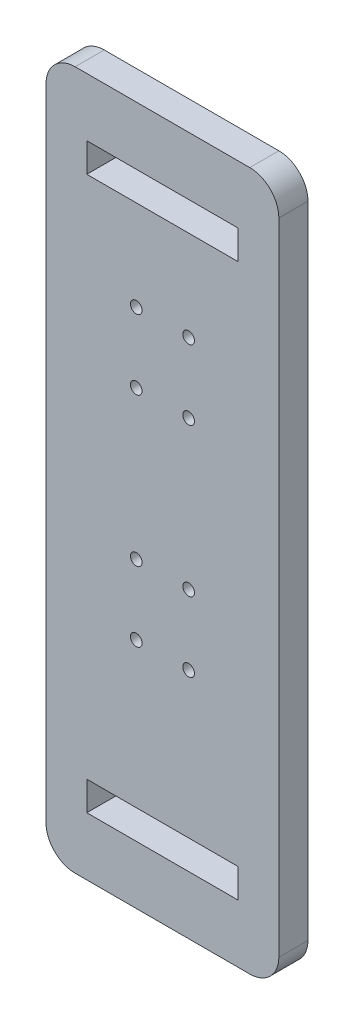
ISO-10303-21;
HEADER;
FILE_DESCRIPTION(('STEP AP214'),'2;1');
FILE_NAME('part.step','',(''),(''),'','','');
FILE_SCHEMA(('AUTOMOTIVE_DESIGN { 1 0 10303 214 1 1 1 1 }'));
ENDSEC;
DATA;
#1=APPLICATION_CONTEXT('core data for automotive mechanical design processes');
#2=APPLICATION_PROTOCOL_DEFINITION('international standard','automotive_design',2000,#1);
#3=PRODUCT_CONTEXT('',#1,'mechanical');
#4=PRODUCT('Part','Part','',(#3));
#5=PRODUCT_RELATED_PRODUCT_CATEGORY('part','',(#4));
#6=PRODUCT_DEFINITION_FORMATION('','',#4);
#7=PRODUCT_DEFINITION_CONTEXT('part definition',#1,'design');
#8=PRODUCT_DEFINITION('design','',#6,#7);
#9=PRODUCT_DEFINITION_SHAPE('','',#8);
#10=(LENGTH_UNIT() NAMED_UNIT(*) SI_UNIT(.MILLI.,.METRE.));
#11=(NAMED_UNIT(*) PLANE_ANGLE_UNIT() SI_UNIT($,.RADIAN.));
#12=(NAMED_UNIT(*) SI_UNIT($,.STERADIAN.) SOLID_ANGLE_UNIT());
#13=UNCERTAINTY_MEASURE_WITH_UNIT(LENGTH_MEASURE(1.E-05),#10,'distance_accuracy_value','');
#14=(GEOMETRIC_REPRESENTATION_CONTEXT(3) GLOBAL_UNCERTAINTY_ASSIGNED_CONTEXT((#13)) GLOBAL_UNIT_ASSIGNED_CONTEXT((#10,
#11,#12)) REPRESENTATION_CONTEXT('',''));
#15=CARTESIAN_POINT('',(0.,0.,0.));
#16=DIRECTION('',(0.,0.,1.));
#17=DIRECTION('',(1.,0.,0.));
#18=AXIS2_PLACEMENT_3D('',#15,#16,#17);
#19=CARTESIAN_POINT('',(0.,0.,10.));
#20=DIRECTION('',(-1.,0.,0.));
#21=DIRECTION('',(0.,0.,1.));
#22=AXIS2_PLACEMENT_3D('',#19,#20,#21);
#23=PLANE('',#22);
#24=DIRECTION('',(0.,1.,0.));
#25=VECTOR('',#24,1.);
#26=CARTESIAN_POINT('',(0.,0.,10.));
#27=LINE('',#26,#25);
#28=CARTESIAN_POINT('',(0.,10.,10.));
#29=VERTEX_POINT('',#28);
#30=CARTESIAN_POINT('',(0.,230.,10.));
#31=VERTEX_POINT('',#30);
#32=EDGE_CURVE('E264',#29,#31,#27,.T.);
#33=ORIENTED_EDGE('',*,*,#32,.F.);
#34=DIRECTION('',(0.,0.,-1.));
#35=VECTOR('',#34,1.);
#36=CARTESIAN_POINT('',(0.,10.,10.));
#37=LINE('',#36,#35);
#38=CARTESIAN_POINT('',(0.,10.,0.));
#39=VERTEX_POINT('',#38);
#40=EDGE_CURVE('E289',#29,#39,#37,.T.);
#41=ORIENTED_EDGE('',*,*,#40,.T.);
#42=DIRECTION('',(0.,1.,0.));
#43=VECTOR('',#42,1.);
#44=CARTESIAN_POINT('',(0.,0.,0.));
#45=LINE('',#44,#43);
#46=CARTESIAN_POINT('',(0.,230.,0.));
#47=VERTEX_POINT('',#46);
#48=EDGE_CURVE('E183',#39,#47,#45,.T.);
#49=ORIENTED_EDGE('',*,*,#48,.T.);
#50=DIRECTION('',(0.,0.,-1.));
#51=VECTOR('',#50,1.);
#52=CARTESIAN_POINT('',(0.,230.,10.));
#53=LINE('',#52,#51);
#54=EDGE_CURVE('E277',#47,#31,#53,.F.);
#55=ORIENTED_EDGE('',*,*,#54,.T.);
#56=EDGE_LOOP('',(#33,#41,#49,#55));
#57=FACE_BOUND('',#56,.T.);
#58=ADVANCED_FACE('F34',(#57),#23,.F.);
#59=CARTESIAN_POINT('',(0.,240.,10.));
#60=DIRECTION('',(0.,-1.,0.));
#61=DIRECTION('',(0.,0.,-1.));
#62=AXIS2_PLACEMENT_3D('',#59,#60,#61);
#63=PLANE('',#62);
#64=DIRECTION('',(-1.,0.,0.));
#65=VECTOR('',#64,1.);
#66=CARTESIAN_POINT('',(0.,240.,0.));
#67=LINE('',#66,#65);
#68=CARTESIAN_POINT('',(-10.,240.,0.));
#69=VERTEX_POINT('',#68);
#70=CARTESIAN_POINT('',(-70.,240.,0.));
#71=VERTEX_POINT('',#70);
#72=EDGE_CURVE('E280',#69,#71,#67,.T.);
#73=ORIENTED_EDGE('',*,*,#72,.T.);
#74=DIRECTION('',(0.,0.,-1.));
#75=VECTOR('',#74,1.);
#76=CARTESIAN_POINT('',(-70.,240.,10.));
#77=LINE('',#76,#75);
#78=CARTESIAN_POINT('',(-70.,240.,10.));
#79=VERTEX_POINT('',#78);
#80=EDGE_CURVE('E11',#71,#79,#77,.F.);
#81=ORIENTED_EDGE('',*,*,#80,.T.);
#82=DIRECTION('',(-1.,0.,0.));
#83=VECTOR('',#82,1.);
#84=CARTESIAN_POINT('',(0.,240.,10.));
#85=LINE('',#84,#83);
#86=CARTESIAN_POINT('',(-10.,240.,10.));
#87=VERTEX_POINT('',#86);
#88=EDGE_CURVE('E267',#87,#79,#85,.T.);
#89=ORIENTED_EDGE('',*,*,#88,.F.);
#90=DIRECTION('',(0.,0.,-1.));
#91=VECTOR('',#90,1.);
#92=CARTESIAN_POINT('',(-10.,240.,10.));
#93=LINE('',#92,#91);
#94=EDGE_CURVE('E42',#87,#69,#93,.T.);
#95=ORIENTED_EDGE('',*,*,#94,.T.);
#96=EDGE_LOOP('',(#73,#81,#89,#95));
#97=FACE_BOUND('',#96,.T.);
#98=ADVANCED_FACE('F322',(#97),#63,.F.);
#99=CARTESIAN_POINT('',(-80.,0.,10.));
#100=DIRECTION('',(1.,0.,0.));
#101=DIRECTION('',(0.,1.,0.));
#102=AXIS2_PLACEMENT_3D('',#99,#100,#101);
#103=PLANE('',#102);
#104=DIRECTION('',(0.,-1.,0.));
#105=VECTOR('',#104,1.);
#106=CARTESIAN_POINT('',(-80.,0.,0.));
#107=LINE('',#106,#105);
#108=CARTESIAN_POINT('',(-80.,230.,0.));
#109=VERTEX_POINT('',#108);
#110=CARTESIAN_POINT('',(-80.,9.99999999999999,0.));
#111=VERTEX_POINT('',#110);
#112=EDGE_CURVE('E283',#109,#111,#107,.T.);
#113=ORIENTED_EDGE('',*,*,#112,.T.);
#114=DIRECTION('',(0.,0.,-1.));
#115=VECTOR('',#114,1.);
#116=CARTESIAN_POINT('',(-80.,9.99999999999999,10.));
#117=LINE('',#116,#115);
#118=CARTESIAN_POINT('',(-80.,9.99999999999999,10.));
#119=VERTEX_POINT('',#118);
#120=EDGE_CURVE('E316',#111,#119,#117,.F.);
#121=ORIENTED_EDGE('',*,*,#120,.T.);
#122=DIRECTION('',(0.,-1.,0.));
#123=VECTOR('',#122,1.);
#124=CARTESIAN_POINT('',(-80.,0.,10.));
#125=LINE('',#124,#123);
#126=CARTESIAN_POINT('',(-80.,230.,10.));
#127=VERTEX_POINT('',#126);
#128=EDGE_CURVE('E271',#127,#119,#125,.T.);
#129=ORIENTED_EDGE('',*,*,#128,.F.);
#130=DIRECTION('',(0.,0.,-1.));
#131=VECTOR('',#130,1.);
#132=CARTESIAN_POINT('',(-80.,230.,10.));
#133=LINE('',#132,#131);
#134=EDGE_CURVE('E313',#127,#109,#133,.T.);
#135=ORIENTED_EDGE('',*,*,#134,.T.);
#136=EDGE_LOOP('',(#113,#121,#129,#135));
#137=FACE_BOUND('',#136,.T.);
#138=ADVANCED_FACE('F335',(#137),#103,.F.);
#139=CARTESIAN_POINT('',(0.,0.,10.));
#140=DIRECTION('',(0.,1.,0.));
#141=DIRECTION('',(-1.,0.,0.));
#142=AXIS2_PLACEMENT_3D('',#139,#140,#141);
#143=PLANE('',#142);
#144=DIRECTION('',(1.,0.,0.));
#145=VECTOR('',#144,1.);
#146=CARTESIAN_POINT('',(0.,0.,0.));
#147=LINE('',#146,#145);
#148=CARTESIAN_POINT('',(-70.,0.,0.));
#149=VERTEX_POINT('',#148);
#150=CARTESIAN_POINT('',(-10.,0.,0.));
#151=VERTEX_POINT('',#150);
#152=EDGE_CURVE('E268',#149,#151,#147,.T.);
#153=ORIENTED_EDGE('',*,*,#152,.T.);
#154=DIRECTION('',(0.,0.,-1.));
#155=VECTOR('',#154,1.);
#156=CARTESIAN_POINT('',(-10.,0.,10.));
#157=LINE('',#156,#155);
#158=CARTESIAN_POINT('',(-10.,0.,10.));
#159=VERTEX_POINT('',#158);
#160=EDGE_CURVE('E303',#151,#159,#157,.F.);
#161=ORIENTED_EDGE('',*,*,#160,.T.);
#162=DIRECTION('',(1.,0.,0.));
#163=VECTOR('',#162,1.);
#164=CARTESIAN_POINT('',(0.,0.,10.));
#165=LINE('',#164,#163);
#166=CARTESIAN_POINT('',(-70.,0.,10.));
#167=VERTEX_POINT('',#166);
#168=EDGE_CURVE('E274',#167,#159,#165,.T.);
#169=ORIENTED_EDGE('',*,*,#168,.F.);
#170=DIRECTION('',(0.,0.,-1.));
#171=VECTOR('',#170,1.);
#172=CARTESIAN_POINT('',(-70.,0.,10.));
#173=LINE('',#172,#171);
#174=EDGE_CURVE('E300',#167,#149,#173,.T.);
#175=ORIENTED_EDGE('',*,*,#174,.T.);
#176=EDGE_LOOP('',(#153,#161,#169,#175));
#177=FACE_BOUND('',#176,.T.);
#178=ADVANCED_FACE('F346',(#177),#143,.F.);
#179=CARTESIAN_POINT('',(0.,0.,10.));
#180=DIRECTION('',(0.,0.,1.));
#181=DIRECTION('',(1.,0.,0.));
#182=AXIS2_PLACEMENT_3D('',#179,#180,#181);
#183=PLANE('',#182);
#184=DIRECTION('',(0.,-1.,0.));
#185=VECTOR('',#184,1.);
#186=CARTESIAN_POINT('',(-66.,210.,10.));
#187=LINE('',#186,#185);
#188=CARTESIAN_POINT('',(-66.,220.,10.));
#189=VERTEX_POINT('',#188);
#190=CARTESIAN_POINT('',(-66.,210.,10.));
#191=VERTEX_POINT('',#190);
#192=EDGE_CURVE('E49',#189,#191,#187,.T.);
#193=ORIENTED_EDGE('',*,*,#192,.F.);
#194=DIRECTION('',(-1.,0.,0.));
#195=VECTOR('',#194,1.);
#196=CARTESIAN_POINT('',(-14.,220.,10.));
#197=LINE('',#196,#195);
#198=CARTESIAN_POINT('',(-14.,220.,10.));
#199=VERTEX_POINT('',#198);
#200=EDGE_CURVE('E167',#199,#189,#197,.T.);
#201=ORIENTED_EDGE('',*,*,#200,.F.);
#202=DIRECTION('',(0.,1.,0.));
#203=VECTOR('',#202,1.);
#204=CARTESIAN_POINT('',(-14.,210.,10.));
#205=LINE('',#204,#203);
#206=CARTESIAN_POINT('',(-14.,210.,10.));
#207=VERTEX_POINT('',#206);
#208=EDGE_CURVE('E170',#207,#199,#205,.T.);
#209=ORIENTED_EDGE('',*,*,#208,.F.);
#210=DIRECTION('',(1.,0.,0.));
#211=VECTOR('',#210,1.);
#212=CARTESIAN_POINT('',(-14.,210.,10.));
#213=LINE('',#212,#211);
#214=EDGE_CURVE('E176',#191,#207,#213,.T.);
#215=ORIENTED_EDGE('',*,*,#214,.F.);
#216=EDGE_LOOP('',(#193,#201,#209,#215));
#217=FACE_BOUND('',#216,.T.);
#218=CARTESIAN_POINT('',(-48.9999999999992,103.94,10.));
#219=DIRECTION('',(0.,0.,1.));
#220=DIRECTION('',(1.,0.,0.));
#221=AXIS2_PLACEMENT_3D('',#218,#219,#220);
#222=CIRCLE('',#221,2.);
#223=CARTESIAN_POINT('',(-46.9999999999992,103.94,10.));
#224=VERTEX_POINT('',#223);
#225=EDGE_CURVE('E191',#224,#224,#222,.T.);
#226=ORIENTED_EDGE('',*,*,#225,.F.);
#227=EDGE_LOOP('',(#226));
#228=FACE_BOUND('',#227,.T.);
#229=CARTESIAN_POINT('',(-31.,178.94,10.));
#230=DIRECTION('',(0.,0.,1.));
#231=DIRECTION('',(1.,0.,0.));
#232=AXIS2_PLACEMENT_3D('',#229,#230,#231);
#233=CIRCLE('',#232,2.);
#234=CARTESIAN_POINT('',(-29.,178.94,10.));
#235=VERTEX_POINT('',#234);
#236=EDGE_CURVE('E197',#235,#235,#233,.T.);
#237=ORIENTED_EDGE('',*,*,#236,.F.);
#238=EDGE_LOOP('',(#237));
#239=FACE_BOUND('',#238,.T.);
#240=CARTESIAN_POINT('',(-31.,154.94,10.));
#241=DIRECTION('',(0.,0.,1.));
#242=DIRECTION('',(1.,0.,0.));
#243=AXIS2_PLACEMENT_3D('',#240,#241,#242);
#244=CIRCLE('',#243,2.);
#245=CARTESIAN_POINT('',(-29.,154.94,10.));
#246=VERTEX_POINT('',#245);
#247=EDGE_CURVE('E222',#246,#246,#244,.T.);
#248=ORIENTED_EDGE('',*,*,#247,.F.);
#249=EDGE_LOOP('',(#248));
#250=FACE_BOUND('',#249,.T.);
#251=CARTESIAN_POINT('',(-49.,154.94,10.));
#252=DIRECTION('',(0.,0.,1.));
#253=DIRECTION('',(1.,0.,0.));
#254=AXIS2_PLACEMENT_3D('',#251,#252,#253);
#255=CIRCLE('',#254,2.);
#256=CARTESIAN_POINT('',(-47.,154.94,10.));
#257=VERTEX_POINT('',#256);
#258=EDGE_CURVE('E221',#257,#257,#255,.T.);
#259=ORIENTED_EDGE('',*,*,#258,.F.);
#260=EDGE_LOOP('',(#259));
#261=FACE_BOUND('',#260,.T.);
#262=DIRECTION('',(0.,-1.,0.));
#263=VECTOR('',#262,1.);
#264=CARTESIAN_POINT('',(-66.,20.,10.));
#265=LINE('',#264,#263);
#266=CARTESIAN_POINT('',(-66.,30.,10.));
#267=VERTEX_POINT('',#266);
#268=CARTESIAN_POINT('',(-66.,20.,10.));
#269=VERTEX_POINT('',#268);
#270=EDGE_CURVE('E57',#267,#269,#265,.T.);
#271=ORIENTED_EDGE('',*,*,#270,.F.);
#272=DIRECTION('',(-1.,0.,0.));
#273=VECTOR('',#272,1.);
#274=CARTESIAN_POINT('',(-14.,30.,10.));
#275=LINE('',#274,#273);
#276=CARTESIAN_POINT('',(-14.,30.,10.));
#277=VERTEX_POINT('',#276);
#278=EDGE_CURVE('E234',#277,#267,#275,.T.);
#279=ORIENTED_EDGE('',*,*,#278,.F.);
#280=DIRECTION('',(0.,1.,0.));
#281=VECTOR('',#280,1.);
#282=CARTESIAN_POINT('',(-14.,20.,10.));
#283=LINE('',#282,#281);
#284=CARTESIAN_POINT('',(-14.,20.,10.));
#285=VERTEX_POINT('',#284);
#286=EDGE_CURVE('E249',#285,#277,#283,.T.);
#287=ORIENTED_EDGE('',*,*,#286,.F.);
#288=DIRECTION('',(1.,0.,0.));
#289=VECTOR('',#288,1.);
#290=CARTESIAN_POINT('',(-14.,20.,10.));
#291=LINE('',#290,#289);
#292=EDGE_CURVE('E245',#269,#285,#291,.T.);
#293=ORIENTED_EDGE('',*,*,#292,.F.);
#294=EDGE_LOOP('',(#271,#279,#287,#293));
#295=FACE_BOUND('',#294,.T.);
#296=CARTESIAN_POINT('',(-49.,178.94,10.));
#297=DIRECTION('',(0.,0.,1.));
#298=DIRECTION('',(1.,0.,0.));
#299=AXIS2_PLACEMENT_3D('',#296,#297,#298);
#300=CIRCLE('',#299,2.);
#301=CARTESIAN_POINT('',(-47.,178.94,10.));
#302=VERTEX_POINT('',#301);
#303=EDGE_CURVE('E198',#302,#302,#300,.T.);
#304=ORIENTED_EDGE('',*,*,#303,.F.);
#305=EDGE_LOOP('',(#304));
#306=FACE_BOUND('',#305,.T.);
#307=CARTESIAN_POINT('',(-48.9999999999992,79.94,10.));
#308=DIRECTION('',(0.,0.,1.));
#309=DIRECTION('',(1.,0.,0.));
#310=AXIS2_PLACEMENT_3D('',#307,#308,#309);
#311=CIRCLE('',#310,2.);
#312=CARTESIAN_POINT('',(-46.9999999999992,79.94,10.));
#313=VERTEX_POINT('',#312);
#314=EDGE_CURVE('E204',#313,#313,#311,.T.);
#315=ORIENTED_EDGE('',*,*,#314,.F.);
#316=EDGE_LOOP('',(#315));
#317=FACE_BOUND('',#316,.T.);
#318=CARTESIAN_POINT('',(-30.9999999999992,79.94,10.));
#319=DIRECTION('',(0.,0.,1.));
#320=DIRECTION('',(1.,0.,0.));
#321=AXIS2_PLACEMENT_3D('',#318,#319,#320);
#322=CIRCLE('',#321,2.);
#323=CARTESIAN_POINT('',(-28.9999999999992,79.94,10.));
#324=VERTEX_POINT('',#323);
#325=EDGE_CURVE('E210',#324,#324,#322,.T.);
#326=ORIENTED_EDGE('',*,*,#325,.F.);
#327=EDGE_LOOP('',(#326));
#328=FACE_BOUND('',#327,.T.);
#329=CARTESIAN_POINT('',(-30.9999999999992,103.94,10.));
#330=DIRECTION('',(0.,0.,1.));
#331=DIRECTION('',(1.,0.,0.));
#332=AXIS2_PLACEMENT_3D('',#329,#330,#331);
#333=CIRCLE('',#332,2.);
#334=CARTESIAN_POINT('',(-28.9999999999992,103.94,10.));
#335=VERTEX_POINT('',#334);
#336=EDGE_CURVE('E190',#335,#335,#333,.T.);
#337=ORIENTED_EDGE('',*,*,#336,.F.);
#338=EDGE_LOOP('',(#337));
#339=FACE_BOUND('',#338,.T.);
#340=ORIENTED_EDGE('',*,*,#168,.T.);
#341=CARTESIAN_POINT('',(-10.,10.,10.));
#342=DIRECTION('',(0.,0.,1.));
#343=DIRECTION('',(1.,0.,0.));
#344=AXIS2_PLACEMENT_3D('',#341,#342,#343);
#345=CIRCLE('',#344,10.);
#346=EDGE_CURVE('E311',#159,#29,#345,.T.);
#347=ORIENTED_EDGE('',*,*,#346,.T.);
#348=ORIENTED_EDGE('',*,*,#32,.T.);
#349=CARTESIAN_POINT('',(-10.,230.,10.));
#350=DIRECTION('',(0.,0.,1.));
#351=DIRECTION('',(1.,0.,0.));
#352=AXIS2_PLACEMENT_3D('',#349,#350,#351);
#353=CIRCLE('',#352,10.);
#354=EDGE_CURVE('E305',#31,#87,#353,.T.);
#355=ORIENTED_EDGE('',*,*,#354,.T.);
#356=ORIENTED_EDGE('',*,*,#88,.T.);
#357=CARTESIAN_POINT('',(-70.,230.,10.));
#358=DIRECTION('',(0.,0.,1.));
#359=DIRECTION('',(1.,0.,0.));
#360=AXIS2_PLACEMENT_3D('',#357,#358,#359);
#361=CIRCLE('',#360,10.);
#362=EDGE_CURVE('E307',#79,#127,#361,.T.);
#363=ORIENTED_EDGE('',*,*,#362,.T.);
#364=ORIENTED_EDGE('',*,*,#128,.T.);
#365=CARTESIAN_POINT('',(-70.,9.99999999999999,10.));
#366=DIRECTION('',(0.,0.,1.));
#367=DIRECTION('',(1.,0.,0.));
#368=AXIS2_PLACEMENT_3D('',#365,#366,#367);
#369=CIRCLE('',#368,10.);
#370=EDGE_CURVE('E309',#119,#167,#369,.T.);
#371=ORIENTED_EDGE('',*,*,#370,.T.);
#372=EDGE_LOOP('',(#340,#347,#348,#355,#356,#363,#364,#371));
#373=FACE_BOUND('',#372,.T.);
#374=ADVANCED_FACE('F339',(#217,#228,#239,#250,#261,#295,#306,#317,#328,#339,#373),#183,.T.);
#375=CARTESIAN_POINT('',(0.,0.,0.));
#376=DIRECTION('',(0.,0.,1.));
#377=DIRECTION('',(1.,0.,0.));
#378=AXIS2_PLACEMENT_3D('',#375,#376,#377);
#379=PLANE('',#378);
#380=DIRECTION('',(-1.,0.,0.));
#381=VECTOR('',#380,1.);
#382=CARTESIAN_POINT('',(-14.,220.,0.));
#383=LINE('',#382,#381);
#384=CARTESIAN_POINT('',(-14.,220.,0.));
#385=VERTEX_POINT('',#384);
#386=CARTESIAN_POINT('',(-66.,220.,0.));
#387=VERTEX_POINT('',#386);
#388=EDGE_CURVE('E154',#385,#387,#383,.T.);
#389=ORIENTED_EDGE('',*,*,#388,.T.);
#390=DIRECTION('',(0.,-1.,0.));
#391=VECTOR('',#390,1.);
#392=CARTESIAN_POINT('',(-66.,210.,0.));
#393=LINE('',#392,#391);
#394=CARTESIAN_POINT('',(-66.,210.,0.));
#395=VERTEX_POINT('',#394);
#396=EDGE_CURVE('E148',#387,#395,#393,.T.);
#397=ORIENTED_EDGE('',*,*,#396,.T.);
#398=DIRECTION('',(1.,0.,0.));
#399=VECTOR('',#398,1.);
#400=CARTESIAN_POINT('',(-14.,210.,0.));
#401=LINE('',#400,#399);
#402=CARTESIAN_POINT('',(-14.,210.,0.));
#403=VERTEX_POINT('',#402);
#404=EDGE_CURVE('E158',#395,#403,#401,.T.);
#405=ORIENTED_EDGE('',*,*,#404,.T.);
#406=DIRECTION('',(0.,1.,0.));
#407=VECTOR('',#406,1.);
#408=CARTESIAN_POINT('',(-14.,210.,0.));
#409=LINE('',#408,#407);
#410=EDGE_CURVE('E162',#403,#385,#409,.T.);
#411=ORIENTED_EDGE('',*,*,#410,.T.);
#412=EDGE_LOOP('',(#389,#397,#405,#411));
#413=FACE_BOUND('',#412,.T.);
#414=CARTESIAN_POINT('',(-48.9999999999992,103.94,0.));
#415=DIRECTION('',(0.,0.,1.));
#416=DIRECTION('',(1.,0.,0.));
#417=AXIS2_PLACEMENT_3D('',#414,#415,#416);
#418=CIRCLE('',#417,2.);
#419=CARTESIAN_POINT('',(-46.9999999999992,103.94,0.));
#420=VERTEX_POINT('',#419);
#421=EDGE_CURVE('E187',#420,#420,#418,.T.);
#422=ORIENTED_EDGE('',*,*,#421,.T.);
#423=EDGE_LOOP('',(#422));
#424=FACE_BOUND('',#423,.T.);
#425=CARTESIAN_POINT('',(-31.,178.94,0.));
#426=DIRECTION('',(0.,0.,1.));
#427=DIRECTION('',(1.,0.,0.));
#428=AXIS2_PLACEMENT_3D('',#425,#426,#427);
#429=CIRCLE('',#428,2.);
#430=CARTESIAN_POINT('',(-29.,178.94,0.));
#431=VERTEX_POINT('',#430);
#432=EDGE_CURVE('E225',#431,#431,#429,.T.);
#433=ORIENTED_EDGE('',*,*,#432,.T.);
#434=EDGE_LOOP('',(#433));
#435=FACE_BOUND('',#434,.T.);
#436=CARTESIAN_POINT('',(-31.,154.94,0.));
#437=DIRECTION('',(0.,0.,1.));
#438=DIRECTION('',(1.,0.,0.));
#439=AXIS2_PLACEMENT_3D('',#436,#437,#438);
#440=CIRCLE('',#439,2.);
#441=CARTESIAN_POINT('',(-29.,154.94,0.));
#442=VERTEX_POINT('',#441);
#443=EDGE_CURVE('E218',#442,#442,#440,.T.);
#444=ORIENTED_EDGE('',*,*,#443,.T.);
#445=EDGE_LOOP('',(#444));
#446=FACE_BOUND('',#445,.T.);
#447=CARTESIAN_POINT('',(-49.,154.94,0.));
#448=DIRECTION('',(0.,0.,1.));
#449=DIRECTION('',(1.,0.,0.));
#450=AXIS2_PLACEMENT_3D('',#447,#448,#449);
#451=CIRCLE('',#450,2.);
#452=CARTESIAN_POINT('',(-47.,154.94,0.));
#453=VERTEX_POINT('',#452);
#454=EDGE_CURVE('E246',#453,#453,#451,.T.);
#455=ORIENTED_EDGE('',*,*,#454,.T.);
#456=EDGE_LOOP('',(#455));
#457=FACE_BOUND('',#456,.T.);
#458=DIRECTION('',(-1.,0.,0.));
#459=VECTOR('',#458,1.);
#460=CARTESIAN_POINT('',(-14.,30.,0.));
#461=LINE('',#460,#459);
#462=CARTESIAN_POINT('',(-14.,30.,0.));
#463=VERTEX_POINT('',#462);
#464=CARTESIAN_POINT('',(-66.,30.,0.));
#465=VERTEX_POINT('',#464);
#466=EDGE_CURVE('E240',#463,#465,#461,.T.);
#467=ORIENTED_EDGE('',*,*,#466,.T.);
#468=DIRECTION('',(0.,-1.,0.));
#469=VECTOR('',#468,1.);
#470=CARTESIAN_POINT('',(-66.,20.,0.));
#471=LINE('',#470,#469);
#472=CARTESIAN_POINT('',(-66.,20.,0.));
#473=VERTEX_POINT('',#472);
#474=EDGE_CURVE('E230',#465,#473,#471,.T.);
#475=ORIENTED_EDGE('',*,*,#474,.T.);
#476=DIRECTION('',(1.,0.,0.));
#477=VECTOR('',#476,1.);
#478=CARTESIAN_POINT('',(-14.,20.,0.));
#479=LINE('',#478,#477);
#480=CARTESIAN_POINT('',(-14.,20.,0.));
#481=VERTEX_POINT('',#480);
#482=EDGE_CURVE('E233',#473,#481,#479,.T.);
#483=ORIENTED_EDGE('',*,*,#482,.T.);
#484=DIRECTION('',(0.,1.,0.));
#485=VECTOR('',#484,1.);
#486=CARTESIAN_POINT('',(-14.,20.,0.));
#487=LINE('',#486,#485);
#488=EDGE_CURVE('E237',#481,#463,#487,.T.);
#489=ORIENTED_EDGE('',*,*,#488,.T.);
#490=EDGE_LOOP('',(#467,#475,#483,#489));
#491=FACE_BOUND('',#490,.T.);
#492=CARTESIAN_POINT('',(-49.,178.94,0.));
#493=DIRECTION('',(0.,0.,1.));
#494=DIRECTION('',(1.,0.,0.));
#495=AXIS2_PLACEMENT_3D('',#492,#493,#494);
#496=CIRCLE('',#495,2.);
#497=CARTESIAN_POINT('',(-47.,178.94,0.));
#498=VERTEX_POINT('',#497);
#499=EDGE_CURVE('E194',#498,#498,#496,.T.);
#500=ORIENTED_EDGE('',*,*,#499,.T.);
#501=EDGE_LOOP('',(#500));
#502=FACE_BOUND('',#501,.T.);
#503=CARTESIAN_POINT('',(-48.9999999999992,79.94,0.));
#504=DIRECTION('',(0.,0.,1.));
#505=DIRECTION('',(1.,0.,0.));
#506=AXIS2_PLACEMENT_3D('',#503,#504,#505);
#507=CIRCLE('',#506,2.);
#508=CARTESIAN_POINT('',(-46.9999999999992,79.94,0.));
#509=VERTEX_POINT('',#508);
#510=EDGE_CURVE('E201',#509,#509,#507,.T.);
#511=ORIENTED_EDGE('',*,*,#510,.T.);
#512=EDGE_LOOP('',(#511));
#513=FACE_BOUND('',#512,.T.);
#514=CARTESIAN_POINT('',(-30.9999999999992,79.94,0.));
#515=DIRECTION('',(0.,0.,1.));
#516=DIRECTION('',(1.,0.,0.));
#517=AXIS2_PLACEMENT_3D('',#514,#515,#516);
#518=CIRCLE('',#517,2.);
#519=CARTESIAN_POINT('',(-28.9999999999992,79.94,0.));
#520=VERTEX_POINT('',#519);
#521=EDGE_CURVE('E207',#520,#520,#518,.T.);
#522=ORIENTED_EDGE('',*,*,#521,.T.);
#523=EDGE_LOOP('',(#522));
#524=FACE_BOUND('',#523,.T.);
#525=CARTESIAN_POINT('',(-30.9999999999992,103.94,0.));
#526=DIRECTION('',(0.,0.,1.));
#527=DIRECTION('',(1.,0.,0.));
#528=AXIS2_PLACEMENT_3D('',#525,#526,#527);
#529=CIRCLE('',#528,2.);
#530=CARTESIAN_POINT('',(-28.9999999999992,103.94,0.));
#531=VERTEX_POINT('',#530);
#532=EDGE_CURVE('E213',#531,#531,#529,.T.);
#533=ORIENTED_EDGE('',*,*,#532,.T.);
#534=EDGE_LOOP('',(#533));
#535=FACE_BOUND('',#534,.T.);
#536=ORIENTED_EDGE('',*,*,#48,.F.);
#537=CARTESIAN_POINT('',(-10.,10.,0.));
#538=DIRECTION('',(0.,0.,1.));
#539=DIRECTION('',(1.,0.,0.));
#540=AXIS2_PLACEMENT_3D('',#537,#538,#539);
#541=CIRCLE('',#540,10.);
#542=EDGE_CURVE('E298',#39,#151,#541,.F.);
#543=ORIENTED_EDGE('',*,*,#542,.T.);
#544=ORIENTED_EDGE('',*,*,#152,.F.);
#545=CARTESIAN_POINT('',(-70.,9.99999999999999,0.));
#546=DIRECTION('',(0.,0.,1.));
#547=DIRECTION('',(1.,0.,0.));
#548=AXIS2_PLACEMENT_3D('',#545,#546,#547);
#549=CIRCLE('',#548,10.);
#550=EDGE_CURVE('E296',#149,#111,#549,.F.);
#551=ORIENTED_EDGE('',*,*,#550,.T.);
#552=ORIENTED_EDGE('',*,*,#112,.F.);
#553=CARTESIAN_POINT('',(-70.,230.,0.));
#554=DIRECTION('',(0.,0.,1.));
#555=DIRECTION('',(1.,0.,0.));
#556=AXIS2_PLACEMENT_3D('',#553,#554,#555);
#557=CIRCLE('',#556,10.);
#558=EDGE_CURVE('E294',#109,#71,#557,.F.);
#559=ORIENTED_EDGE('',*,*,#558,.T.);
#560=ORIENTED_EDGE('',*,*,#72,.F.);
#561=CARTESIAN_POINT('',(-10.,230.,0.));
#562=DIRECTION('',(0.,0.,1.));
#563=DIRECTION('',(1.,0.,0.));
#564=AXIS2_PLACEMENT_3D('',#561,#562,#563);
#565=CIRCLE('',#564,10.);
#566=EDGE_CURVE('E292',#69,#47,#565,.F.);
#567=ORIENTED_EDGE('',*,*,#566,.T.);
#568=EDGE_LOOP('',(#536,#543,#544,#551,#552,#559,#560,#567));
#569=FACE_BOUND('',#568,.T.);
#570=ADVANCED_FACE('F164',(#413,#424,#435,#446,#457,#491,#502,#513,#524,#535,#569),#379,.F.);
#571=CARTESIAN_POINT('',(-10.,10.,10.));
#572=DIRECTION('',(0.,0.,-1.));
#573=DIRECTION('',(-1.,0.,0.));
#574=AXIS2_PLACEMENT_3D('',#571,#572,#573);
#575=CYLINDRICAL_SURFACE('',#574,10.);
#576=ORIENTED_EDGE('',*,*,#346,.F.);
#577=ORIENTED_EDGE('',*,*,#160,.F.);
#578=ORIENTED_EDGE('',*,*,#542,.F.);
#579=ORIENTED_EDGE('',*,*,#40,.F.);
#580=EDGE_LOOP('',(#576,#577,#578,#579));
#581=FACE_BOUND('',#580,.T.);
#582=ADVANCED_FACE('F351',(#581),#575,.T.);
#583=CARTESIAN_POINT('',(-70.,9.99999999999999,10.));
#584=DIRECTION('',(0.,0.,-1.));
#585=DIRECTION('',(-1.,0.,0.));
#586=AXIS2_PLACEMENT_3D('',#583,#584,#585);
#587=CYLINDRICAL_SURFACE('',#586,10.);
#588=ORIENTED_EDGE('',*,*,#370,.F.);
#589=ORIENTED_EDGE('',*,*,#120,.F.);
#590=ORIENTED_EDGE('',*,*,#550,.F.);
#591=ORIENTED_EDGE('',*,*,#174,.F.);
#592=EDGE_LOOP('',(#588,#589,#590,#591));
#593=FACE_BOUND('',#592,.T.);
#594=ADVANCED_FACE('F343',(#593),#587,.T.);
#595=CARTESIAN_POINT('',(-70.,230.,10.));
#596=DIRECTION('',(0.,0.,-1.));
#597=DIRECTION('',(-1.,0.,0.));
#598=AXIS2_PLACEMENT_3D('',#595,#596,#597);
#599=CYLINDRICAL_SURFACE('',#598,10.);
#600=ORIENTED_EDGE('',*,*,#362,.F.);
#601=ORIENTED_EDGE('',*,*,#80,.F.);
#602=ORIENTED_EDGE('',*,*,#558,.F.);
#603=ORIENTED_EDGE('',*,*,#134,.F.);
#604=EDGE_LOOP('',(#600,#601,#602,#603));
#605=FACE_BOUND('',#604,.T.);
#606=ADVANCED_FACE('F332',(#605),#599,.T.);
#607=CARTESIAN_POINT('',(-10.,230.,10.));
#608=DIRECTION('',(0.,0.,-1.));
#609=DIRECTION('',(-1.,0.,0.));
#610=AXIS2_PLACEMENT_3D('',#607,#608,#609);
#611=CYLINDRICAL_SURFACE('',#610,10.);
#612=ORIENTED_EDGE('',*,*,#354,.F.);
#613=ORIENTED_EDGE('',*,*,#54,.F.);
#614=ORIENTED_EDGE('',*,*,#566,.F.);
#615=ORIENTED_EDGE('',*,*,#94,.F.);
#616=EDGE_LOOP('',(#612,#613,#614,#615));
#617=FACE_BOUND('',#616,.T.);
#618=ADVANCED_FACE('F36',(#617),#611,.T.);
#619=CARTESIAN_POINT('',(-30.9999999999992,103.94,0.));
#620=DIRECTION('',(0.,0.,1.));
#621=DIRECTION('',(1.,0.,0.));
#622=AXIS2_PLACEMENT_3D('',#619,#620,#621);
#623=CYLINDRICAL_SURFACE('',#622,2.);
#624=ORIENTED_EDGE('',*,*,#532,.F.);
#625=EDGE_LOOP('',(#624));
#626=FACE_BOUND('',#625,.T.);
#627=ORIENTED_EDGE('',*,*,#336,.T.);
#628=EDGE_LOOP('',(#627));
#629=FACE_BOUND('',#628,.T.);
#630=ADVANCED_FACE('F356',(#626,#629),#623,.F.);
#631=CARTESIAN_POINT('',(-30.9999999999992,79.94,0.));
#632=DIRECTION('',(0.,0.,1.));
#633=DIRECTION('',(1.,0.,0.));
#634=AXIS2_PLACEMENT_3D('',#631,#632,#633);
#635=CYLINDRICAL_SURFACE('',#634,2.);
#636=ORIENTED_EDGE('',*,*,#521,.F.);
#637=EDGE_LOOP('',(#636));
#638=FACE_BOUND('',#637,.T.);
#639=ORIENTED_EDGE('',*,*,#325,.T.);
#640=EDGE_LOOP('',(#639));
#641=FACE_BOUND('',#640,.T.);
#642=ADVANCED_FACE('F361',(#638,#641),#635,.F.);
#643=CARTESIAN_POINT('',(-48.9999999999992,79.94,0.));
#644=DIRECTION('',(0.,0.,1.));
#645=DIRECTION('',(1.,0.,0.));
#646=AXIS2_PLACEMENT_3D('',#643,#644,#645);
#647=CYLINDRICAL_SURFACE('',#646,2.);
#648=ORIENTED_EDGE('',*,*,#510,.F.);
#649=EDGE_LOOP('',(#648));
#650=FACE_BOUND('',#649,.T.);
#651=ORIENTED_EDGE('',*,*,#314,.T.);
#652=EDGE_LOOP('',(#651));
#653=FACE_BOUND('',#652,.T.);
#654=ADVANCED_FACE('F422',(#650,#653),#647,.F.);
#655=CARTESIAN_POINT('',(-49.,178.94,0.));
#656=DIRECTION('',(0.,0.,1.));
#657=DIRECTION('',(1.,0.,0.));
#658=AXIS2_PLACEMENT_3D('',#655,#656,#657);
#659=CYLINDRICAL_SURFACE('',#658,2.);
#660=ORIENTED_EDGE('',*,*,#499,.F.);
#661=EDGE_LOOP('',(#660));
#662=FACE_BOUND('',#661,.T.);
#663=ORIENTED_EDGE('',*,*,#303,.T.);
#664=EDGE_LOOP('',(#663));
#665=FACE_BOUND('',#664,.T.);
#666=ADVANCED_FACE('F432',(#662,#665),#659,.F.);
#667=CARTESIAN_POINT('',(-66.,20.,0.));
#668=DIRECTION('',(-1.,0.,0.));
#669=DIRECTION('',(0.,0.,1.));
#670=AXIS2_PLACEMENT_3D('',#667,#668,#669);
#671=PLANE('',#670);
#672=ORIENTED_EDGE('',*,*,#270,.T.);
#673=DIRECTION('',(0.,0.,1.));
#674=VECTOR('',#673,1.);
#675=CARTESIAN_POINT('',(-66.,20.,0.));
#676=LINE('',#675,#674);
#677=EDGE_CURVE('E243',#473,#269,#676,.T.);
#678=ORIENTED_EDGE('',*,*,#677,.F.);
#679=ORIENTED_EDGE('',*,*,#474,.F.);
#680=DIRECTION('',(0.,0.,1.));
#681=VECTOR('',#680,1.);
#682=CARTESIAN_POINT('',(-66.,30.,0.));
#683=LINE('',#682,#681);
#684=EDGE_CURVE('E177',#465,#267,#683,.T.);
#685=ORIENTED_EDGE('',*,*,#684,.T.);
#686=EDGE_LOOP('',(#672,#678,#679,#685));
#687=FACE_BOUND('',#686,.T.);
#688=ADVANCED_FACE('F442',(#687),#671,.F.);
#689=CARTESIAN_POINT('',(-14.,30.,0.));
#690=DIRECTION('',(0.,1.,0.));
#691=DIRECTION('',(-1.,0.,0.));
#692=AXIS2_PLACEMENT_3D('',#689,#690,#691);
#693=PLANE('',#692);
#694=ORIENTED_EDGE('',*,*,#278,.T.);
#695=ORIENTED_EDGE('',*,*,#684,.F.);
#696=ORIENTED_EDGE('',*,*,#466,.F.);
#697=DIRECTION('',(0.,0.,1.));
#698=VECTOR('',#697,1.);
#699=CARTESIAN_POINT('',(-14.,30.,0.));
#700=LINE('',#699,#698);
#701=EDGE_CURVE('E255',#463,#277,#700,.T.);
#702=ORIENTED_EDGE('',*,*,#701,.T.);
#703=EDGE_LOOP('',(#694,#695,#696,#702));
#704=FACE_BOUND('',#703,.T.);
#705=ADVANCED_FACE('F452',(#704),#693,.F.);
#706=CARTESIAN_POINT('',(-14.,20.,0.));
#707=DIRECTION('',(1.,0.,0.));
#708=DIRECTION('',(0.,0.,-1.));
#709=AXIS2_PLACEMENT_3D('',#706,#707,#708);
#710=PLANE('',#709);
#711=ORIENTED_EDGE('',*,*,#286,.T.);
#712=ORIENTED_EDGE('',*,*,#701,.F.);
#713=ORIENTED_EDGE('',*,*,#488,.F.);
#714=DIRECTION('',(0.,0.,1.));
#715=VECTOR('',#714,1.);
#716=CARTESIAN_POINT('',(-14.,20.,0.));
#717=LINE('',#716,#715);
#718=EDGE_CURVE('E257',#481,#285,#717,.T.);
#719=ORIENTED_EDGE('',*,*,#718,.T.);
#720=EDGE_LOOP('',(#711,#712,#713,#719));
#721=FACE_BOUND('',#720,.T.);
#722=ADVANCED_FACE('F461',(#721),#710,.F.);
#723=CARTESIAN_POINT('',(-14.,20.,0.));
#724=DIRECTION('',(0.,-1.,0.));
#725=DIRECTION('',(1.,0.,0.));
#726=AXIS2_PLACEMENT_3D('',#723,#724,#725);
#727=PLANE('',#726);
#728=ORIENTED_EDGE('',*,*,#292,.T.);
#729=ORIENTED_EDGE('',*,*,#718,.F.);
#730=ORIENTED_EDGE('',*,*,#482,.F.);
#731=ORIENTED_EDGE('',*,*,#677,.T.);
#732=EDGE_LOOP('',(#728,#729,#730,#731));
#733=FACE_BOUND('',#732,.T.);
#734=ADVANCED_FACE('F471',(#733),#727,.F.);
#735=CARTESIAN_POINT('',(-49.,154.94,0.));
#736=DIRECTION('',(0.,0.,1.));
#737=DIRECTION('',(1.,0.,0.));
#738=AXIS2_PLACEMENT_3D('',#735,#736,#737);
#739=CYLINDRICAL_SURFACE('',#738,2.);
#740=ORIENTED_EDGE('',*,*,#454,.F.);
#741=EDGE_LOOP('',(#740));
#742=FACE_BOUND('',#741,.T.);
#743=ORIENTED_EDGE('',*,*,#258,.T.);
#744=EDGE_LOOP('',(#743));
#745=FACE_BOUND('',#744,.T.);
#746=ADVANCED_FACE('F481',(#742,#745),#739,.F.);
#747=CARTESIAN_POINT('',(-31.,154.94,0.));
#748=DIRECTION('',(0.,0.,1.));
#749=DIRECTION('',(1.,0.,0.));
#750=AXIS2_PLACEMENT_3D('',#747,#748,#749);
#751=CYLINDRICAL_SURFACE('',#750,2.);
#752=ORIENTED_EDGE('',*,*,#443,.F.);
#753=EDGE_LOOP('',(#752));
#754=FACE_BOUND('',#753,.T.);
#755=ORIENTED_EDGE('',*,*,#247,.T.);
#756=EDGE_LOOP('',(#755));
#757=FACE_BOUND('',#756,.T.);
#758=ADVANCED_FACE('F491',(#754,#757),#751,.F.);
#759=CARTESIAN_POINT('',(-31.,178.94,0.));
#760=DIRECTION('',(0.,0.,1.));
#761=DIRECTION('',(1.,0.,0.));
#762=AXIS2_PLACEMENT_3D('',#759,#760,#761);
#763=CYLINDRICAL_SURFACE('',#762,2.);
#764=ORIENTED_EDGE('',*,*,#432,.F.);
#765=EDGE_LOOP('',(#764));
#766=FACE_BOUND('',#765,.T.);
#767=ORIENTED_EDGE('',*,*,#236,.T.);
#768=EDGE_LOOP('',(#767));
#769=FACE_BOUND('',#768,.T.);
#770=ADVANCED_FACE('F501',(#766,#769),#763,.F.);
#771=CARTESIAN_POINT('',(-48.9999999999992,103.94,0.));
#772=DIRECTION('',(0.,0.,1.));
#773=DIRECTION('',(1.,0.,0.));
#774=AXIS2_PLACEMENT_3D('',#771,#772,#773);
#775=CYLINDRICAL_SURFACE('',#774,2.);
#776=ORIENTED_EDGE('',*,*,#421,.F.);
#777=EDGE_LOOP('',(#776));
#778=FACE_BOUND('',#777,.T.);
#779=ORIENTED_EDGE('',*,*,#225,.T.);
#780=EDGE_LOOP('',(#779));
#781=FACE_BOUND('',#780,.T.);
#782=ADVANCED_FACE('F511',(#778,#781),#775,.F.);
#783=CARTESIAN_POINT('',(-66.,210.,0.));
#784=DIRECTION('',(-1.,0.,0.));
#785=DIRECTION('',(0.,0.,1.));
#786=AXIS2_PLACEMENT_3D('',#783,#784,#785);
#787=PLANE('',#786);
#788=ORIENTED_EDGE('',*,*,#192,.T.);
#789=DIRECTION('',(0.,0.,1.));
#790=VECTOR('',#789,1.);
#791=CARTESIAN_POINT('',(-66.,210.,0.));
#792=LINE('',#791,#790);
#793=EDGE_CURVE('E144',#395,#191,#792,.T.);
#794=ORIENTED_EDGE('',*,*,#793,.F.);
#795=ORIENTED_EDGE('',*,*,#396,.F.);
#796=DIRECTION('',(0.,0.,1.));
#797=VECTOR('',#796,1.);
#798=CARTESIAN_POINT('',(-66.,220.,0.));
#799=LINE('',#798,#797);
#800=EDGE_CURVE('E181',#387,#189,#799,.T.);
#801=ORIENTED_EDGE('',*,*,#800,.T.);
#802=EDGE_LOOP('',(#788,#794,#795,#801));
#803=FACE_BOUND('',#802,.T.);
#804=ADVANCED_FACE('F146',(#803),#787,.F.);
#805=CARTESIAN_POINT('',(-14.,220.,0.));
#806=DIRECTION('',(0.,1.,0.));
#807=DIRECTION('',(0.,0.,1.));
#808=AXIS2_PLACEMENT_3D('',#805,#806,#807);
#809=PLANE('',#808);
#810=ORIENTED_EDGE('',*,*,#200,.T.);
#811=ORIENTED_EDGE('',*,*,#800,.F.);
#812=ORIENTED_EDGE('',*,*,#388,.F.);
#813=DIRECTION('',(0.,0.,1.));
#814=VECTOR('',#813,1.);
#815=CARTESIAN_POINT('',(-14.,220.,0.));
#816=LINE('',#815,#814);
#817=EDGE_CURVE('E184',#385,#199,#816,.T.);
#818=ORIENTED_EDGE('',*,*,#817,.T.);
#819=EDGE_LOOP('',(#810,#811,#812,#818));
#820=FACE_BOUND('',#819,.T.);
#821=ADVANCED_FACE('F530',(#820),#809,.F.);
#822=CARTESIAN_POINT('',(-14.,210.,0.));
#823=DIRECTION('',(1.,0.,0.));
#824=DIRECTION('',(0.,0.,-1.));
#825=AXIS2_PLACEMENT_3D('',#822,#823,#824);
#826=PLANE('',#825);
#827=ORIENTED_EDGE('',*,*,#208,.T.);
#828=ORIENTED_EDGE('',*,*,#817,.F.);
#829=ORIENTED_EDGE('',*,*,#410,.F.);
#830=DIRECTION('',(0.,0.,1.));
#831=VECTOR('',#830,1.);
#832=CARTESIAN_POINT('',(-14.,210.,0.));
#833=LINE('',#832,#831);
#834=EDGE_CURVE('E153',#403,#207,#833,.T.);
#835=ORIENTED_EDGE('',*,*,#834,.T.);
#836=EDGE_LOOP('',(#827,#828,#829,#835));
#837=FACE_BOUND('',#836,.T.);
#838=ADVANCED_FACE('F539',(#837),#826,.F.);
#839=CARTESIAN_POINT('',(-14.,210.,0.));
#840=DIRECTION('',(0.,-1.,0.));
#841=DIRECTION('',(0.,0.,-1.));
#842=AXIS2_PLACEMENT_3D('',#839,#840,#841);
#843=PLANE('',#842);
#844=ORIENTED_EDGE('',*,*,#214,.T.);
#845=ORIENTED_EDGE('',*,*,#834,.F.);
#846=ORIENTED_EDGE('',*,*,#404,.F.);
#847=ORIENTED_EDGE('',*,*,#793,.T.);
#848=EDGE_LOOP('',(#844,#845,#846,#847));
#849=FACE_BOUND('',#848,.T.);
#850=ADVANCED_FACE('F159',(#849),#843,.F.);
#851=CLOSED_SHELL('',(#58,#98,#138,#178,#374,#570,#582,#594,#606,#618,#630,#642,#654,#666,#688,
#705,#722,#734,#746,#758,#770,#782,#804,#821,#838,#850));
#852=MANIFOLD_SOLID_BREP('B2',#851);
#853=ADVANCED_BREP_SHAPE_REPRESENTATION('',(#18,#852),#14);
#854=SHAPE_DEFINITION_REPRESENTATION(#9,#853);
ENDSEC;
END-ISO-10303-21;
